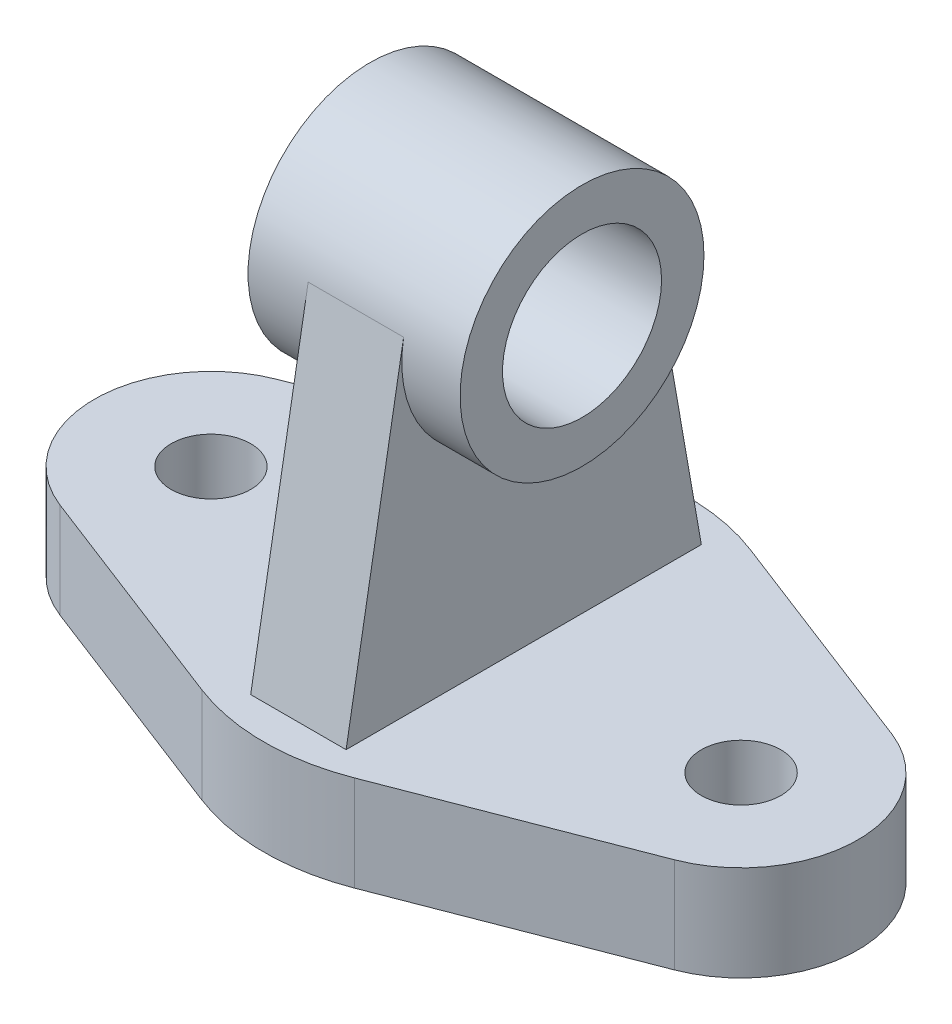
ISO-10303-21;
HEADER;
FILE_DESCRIPTION(('STEP AP214'),'2;1');
FILE_NAME('part.step','',(''),(''),'','','');
FILE_SCHEMA(('AUTOMOTIVE_DESIGN { 1 0 10303 214 1 1 1 1 }'));
ENDSEC;
DATA;
#1=APPLICATION_CONTEXT('core data for automotive mechanical design processes');
#2=APPLICATION_PROTOCOL_DEFINITION('international standard','automotive_design',2000,#1);
#3=PRODUCT_CONTEXT('',#1,'mechanical');
#4=PRODUCT('Part','Part','',(#3));
#5=PRODUCT_RELATED_PRODUCT_CATEGORY('part','',(#4));
#6=PRODUCT_DEFINITION_FORMATION('','',#4);
#7=PRODUCT_DEFINITION_CONTEXT('part definition',#1,'design');
#8=PRODUCT_DEFINITION('design','',#6,#7);
#9=PRODUCT_DEFINITION_SHAPE('','',#8);
#10=(LENGTH_UNIT() NAMED_UNIT(*) SI_UNIT(.MILLI.,.METRE.));
#11=(NAMED_UNIT(*) PLANE_ANGLE_UNIT() SI_UNIT($,.RADIAN.));
#12=(NAMED_UNIT(*) SI_UNIT($,.STERADIAN.) SOLID_ANGLE_UNIT());
#13=UNCERTAINTY_MEASURE_WITH_UNIT(LENGTH_MEASURE(1.E-05),#10,'distance_accuracy_value','');
#14=(GEOMETRIC_REPRESENTATION_CONTEXT(3) GLOBAL_UNCERTAINTY_ASSIGNED_CONTEXT((#13)) GLOBAL_UNIT_ASSIGNED_CONTEXT((#10,
#11,#12)) REPRESENTATION_CONTEXT('',''));
#15=CARTESIAN_POINT('',(0.,0.,0.));
#16=DIRECTION('',(0.,0.,1.));
#17=DIRECTION('',(1.,0.,0.));
#18=AXIS2_PLACEMENT_3D('',#15,#16,#17);
#19=CARTESIAN_POINT('',(-50.,18.,0.));
#20=DIRECTION('',(0.,-1.,0.));
#21=DIRECTION('',(0.,0.,-1.));
#22=AXIS2_PLACEMENT_3D('',#19,#20,#21);
#23=PLANE('',#22);
#24=DIRECTION('',(-1.,0.,0.));
#25=VECTOR('',#24,1.);
#26=CARTESIAN_POINT('',(9.,18.,-33.5));
#27=LINE('',#26,#25);
#28=CARTESIAN_POINT('',(8.99999999999999,18.,-33.5));
#29=VERTEX_POINT('',#28);
#30=CARTESIAN_POINT('',(-9.,18.,-33.5));
#31=VERTEX_POINT('',#30);
#32=EDGE_CURVE('E55',#29,#31,#27,.T.);
#33=ORIENTED_EDGE('',*,*,#32,.F.);
#34=DIRECTION('',(0.,0.,-1.));
#35=VECTOR('',#34,1.);
#36=CARTESIAN_POINT('',(9.,18.,0.));
#37=LINE('',#36,#35);
#38=CARTESIAN_POINT('',(8.99999999999999,18.,33.5));
#39=VERTEX_POINT('',#38);
#40=EDGE_CURVE('E50',#39,#29,#37,.T.);
#41=ORIENTED_EDGE('',*,*,#40,.F.);
#42=DIRECTION('',(-1.,0.,0.));
#43=VECTOR('',#42,1.);
#44=CARTESIAN_POINT('',(9.,18.,33.5));
#45=LINE('',#44,#43);
#46=CARTESIAN_POINT('',(-9.,18.,33.5));
#47=VERTEX_POINT('',#46);
#48=EDGE_CURVE('E144',#39,#47,#45,.T.);
#49=ORIENTED_EDGE('',*,*,#48,.T.);
#50=DIRECTION('',(0.,0.,-1.));
#51=VECTOR('',#50,1.);
#52=CARTESIAN_POINT('',(-9.,18.,0.));
#53=LINE('',#52,#51);
#54=EDGE_CURVE('E147',#47,#31,#53,.T.);
#55=ORIENTED_EDGE('',*,*,#54,.T.);
#56=EDGE_LOOP('',(#33,#41,#49,#55));
#57=FACE_BOUND('',#56,.T.);
#58=CARTESIAN_POINT('',(-50.,18.,0.));
#59=DIRECTION('',(0.,1.,0.));
#60=DIRECTION('',(0.,0.,-1.));
#61=AXIS2_PLACEMENT_3D('',#58,#59,#60);
#62=CIRCLE('',#61,22.);
#63=CARTESIAN_POINT('',(-57.92,18.,-20.5249506698555));
#64=VERTEX_POINT('',#63);
#65=CARTESIAN_POINT('',(-57.92,18.,20.5249506698554));
#66=VERTEX_POINT('',#65);
#67=EDGE_CURVE('E171',#64,#66,#62,.T.);
#68=ORIENTED_EDGE('',*,*,#67,.T.);
#69=DIRECTION('',(0.932952303175248,0.,0.36));
#70=VECTOR('',#69,1.);
#71=CARTESIAN_POINT('',(-57.92,18.,20.5249506698554));
#72=LINE('',#71,#70);
#73=CARTESIAN_POINT('',(-14.4,18.,37.3180921270099));
#74=VERTEX_POINT('',#73);
#75=EDGE_CURVE('E174',#66,#74,#72,.T.);
#76=ORIENTED_EDGE('',*,*,#75,.T.);
#77=CARTESIAN_POINT('',(0.,18.,0.));
#78=DIRECTION('',(0.,1.,0.));
#79=DIRECTION('',(0.,0.,-1.));
#80=AXIS2_PLACEMENT_3D('',#77,#78,#79);
#81=CIRCLE('',#80,40.);
#82=CARTESIAN_POINT('',(14.4,18.,37.3180921270099));
#83=VERTEX_POINT('',#82);
#84=EDGE_CURVE('E177',#74,#83,#81,.T.);
#85=ORIENTED_EDGE('',*,*,#84,.T.);
#86=DIRECTION('',(0.932952303175248,0.,-0.36));
#87=VECTOR('',#86,1.);
#88=CARTESIAN_POINT('',(14.4,18.,37.3180921270099));
#89=LINE('',#88,#87);
#90=CARTESIAN_POINT('',(57.92,18.,20.5249506698554));
#91=VERTEX_POINT('',#90);
#92=EDGE_CURVE('E179',#83,#91,#89,.T.);
#93=ORIENTED_EDGE('',*,*,#92,.T.);
#94=CARTESIAN_POINT('',(50.,18.,0.));
#95=DIRECTION('',(0.,1.,0.));
#96=DIRECTION('',(0.,0.,1.));
#97=AXIS2_PLACEMENT_3D('',#94,#95,#96);
#98=CIRCLE('',#97,22.);
#99=CARTESIAN_POINT('',(57.92,18.,-20.5249506698554));
#100=VERTEX_POINT('',#99);
#101=EDGE_CURVE('E181',#91,#100,#98,.T.);
#102=ORIENTED_EDGE('',*,*,#101,.T.);
#103=DIRECTION('',(-0.932952303175248,0.,-0.36));
#104=VECTOR('',#103,1.);
#105=CARTESIAN_POINT('',(57.92,18.,-20.5249506698555));
#106=LINE('',#105,#104);
#107=CARTESIAN_POINT('',(14.4,18.,-37.3180921270099));
#108=VERTEX_POINT('',#107);
#109=EDGE_CURVE('E183',#100,#108,#106,.T.);
#110=ORIENTED_EDGE('',*,*,#109,.T.);
#111=CARTESIAN_POINT('',(0.,18.,0.));
#112=DIRECTION('',(0.,1.,0.));
#113=DIRECTION('',(0.,0.,1.));
#114=AXIS2_PLACEMENT_3D('',#111,#112,#113);
#115=CIRCLE('',#114,40.);
#116=CARTESIAN_POINT('',(-14.4,18.,-37.3180921270099));
#117=VERTEX_POINT('',#116);
#118=EDGE_CURVE('E185',#108,#117,#115,.T.);
#119=ORIENTED_EDGE('',*,*,#118,.T.);
#120=DIRECTION('',(-0.932952303175248,0.,0.36));
#121=VECTOR('',#120,1.);
#122=CARTESIAN_POINT('',(-14.4,18.,-37.3180921270099));
#123=LINE('',#122,#121);
#124=EDGE_CURVE('E187',#117,#64,#123,.T.);
#125=ORIENTED_EDGE('',*,*,#124,.T.);
#126=EDGE_LOOP('',(#68,#76,#85,#93,#102,#110,#119,#125));
#127=FACE_BOUND('',#126,.T.);
#128=CARTESIAN_POINT('',(50.,18.,0.));
#129=DIRECTION('',(0.,1.,0.));
#130=DIRECTION('',(0.,0.,1.));
#131=AXIS2_PLACEMENT_3D('',#128,#129,#130);
#132=CIRCLE('',#131,7.50000000000001);
#133=CARTESIAN_POINT('',(50.,18.,7.50000000000001));
#134=VERTEX_POINT('',#133);
#135=EDGE_CURVE('E165',#134,#134,#132,.T.);
#136=ORIENTED_EDGE('',*,*,#135,.F.);
#137=EDGE_LOOP('',(#136));
#138=FACE_BOUND('',#137,.T.);
#139=CARTESIAN_POINT('',(-50.,18.,0.));
#140=DIRECTION('',(0.,1.,0.));
#141=DIRECTION('',(0.,0.,1.));
#142=AXIS2_PLACEMENT_3D('',#139,#140,#141);
#143=CIRCLE('',#142,7.5);
#144=CARTESIAN_POINT('',(-50.,18.,7.5));
#145=VERTEX_POINT('',#144);
#146=EDGE_CURVE('E159',#145,#145,#143,.T.);
#147=ORIENTED_EDGE('',*,*,#146,.F.);
#148=EDGE_LOOP('',(#147));
#149=FACE_BOUND('',#148,.T.);
#150=ADVANCED_FACE('F35',(#57,#127,#138,#149),#23,.F.);
#151=CARTESIAN_POINT('',(-50.,0.,0.));
#152=DIRECTION('',(0.,-1.,0.));
#153=DIRECTION('',(0.,0.,-1.));
#154=AXIS2_PLACEMENT_3D('',#151,#152,#153);
#155=PLANE('',#154);
#156=CARTESIAN_POINT('',(50.,0.,0.));
#157=DIRECTION('',(0.,1.,0.));
#158=DIRECTION('',(0.,0.,1.));
#159=AXIS2_PLACEMENT_3D('',#156,#157,#158);
#160=CIRCLE('',#159,7.50000000000001);
#161=CARTESIAN_POINT('',(50.,0.,7.50000000000001));
#162=VERTEX_POINT('',#161);
#163=EDGE_CURVE('E162',#162,#162,#160,.T.);
#164=ORIENTED_EDGE('',*,*,#163,.T.);
#165=EDGE_LOOP('',(#164));
#166=FACE_BOUND('',#165,.T.);
#167=CARTESIAN_POINT('',(-50.,0.,0.));
#168=DIRECTION('',(0.,1.,0.));
#169=DIRECTION('',(0.,0.,-1.));
#170=AXIS2_PLACEMENT_3D('',#167,#168,#169);
#171=CIRCLE('',#170,22.);
#172=CARTESIAN_POINT('',(-57.92,0.,-20.5249506698555));
#173=VERTEX_POINT('',#172);
#174=CARTESIAN_POINT('',(-57.92,0.,20.5249506698554));
#175=VERTEX_POINT('',#174);
#176=EDGE_CURVE('E168',#173,#175,#171,.T.);
#177=ORIENTED_EDGE('',*,*,#176,.F.);
#178=DIRECTION('',(-0.932952303175248,0.,0.36));
#179=VECTOR('',#178,1.);
#180=CARTESIAN_POINT('',(-14.4,0.,-37.3180921270099));
#181=LINE('',#180,#179);
#182=CARTESIAN_POINT('',(-14.4,0.,-37.3180921270099));
#183=VERTEX_POINT('',#182);
#184=EDGE_CURVE('E175',#183,#173,#181,.T.);
#185=ORIENTED_EDGE('',*,*,#184,.F.);
#186=CARTESIAN_POINT('',(0.,0.,0.));
#187=DIRECTION('',(0.,1.,0.));
#188=DIRECTION('',(0.,0.,1.));
#189=AXIS2_PLACEMENT_3D('',#186,#187,#188);
#190=CIRCLE('',#189,40.);
#191=CARTESIAN_POINT('',(14.4,0.,-37.3180921270099));
#192=VERTEX_POINT('',#191);
#193=EDGE_CURVE('E202',#192,#183,#190,.T.);
#194=ORIENTED_EDGE('',*,*,#193,.F.);
#195=DIRECTION('',(-0.932952303175248,0.,-0.36));
#196=VECTOR('',#195,1.);
#197=CARTESIAN_POINT('',(57.92,0.,-20.5249506698555));
#198=LINE('',#197,#196);
#199=CARTESIAN_POINT('',(57.92,0.,-20.5249506698554));
#200=VERTEX_POINT('',#199);
#201=EDGE_CURVE('E200',#200,#192,#198,.T.);
#202=ORIENTED_EDGE('',*,*,#201,.F.);
#203=CARTESIAN_POINT('',(50.,0.,0.));
#204=DIRECTION('',(0.,1.,0.));
#205=DIRECTION('',(0.,0.,1.));
#206=AXIS2_PLACEMENT_3D('',#203,#204,#205);
#207=CIRCLE('',#206,22.);
#208=CARTESIAN_POINT('',(57.92,0.,20.5249506698554));
#209=VERTEX_POINT('',#208);
#210=EDGE_CURVE('E198',#209,#200,#207,.T.);
#211=ORIENTED_EDGE('',*,*,#210,.F.);
#212=DIRECTION('',(0.932952303175248,0.,-0.36));
#213=VECTOR('',#212,1.);
#214=CARTESIAN_POINT('',(14.4,0.,37.3180921270099));
#215=LINE('',#214,#213);
#216=CARTESIAN_POINT('',(14.4,0.,37.3180921270099));
#217=VERTEX_POINT('',#216);
#218=EDGE_CURVE('E196',#217,#209,#215,.T.);
#219=ORIENTED_EDGE('',*,*,#218,.F.);
#220=CARTESIAN_POINT('',(0.,0.,0.));
#221=DIRECTION('',(0.,1.,0.));
#222=DIRECTION('',(0.,0.,-1.));
#223=AXIS2_PLACEMENT_3D('',#220,#221,#222);
#224=CIRCLE('',#223,40.);
#225=CARTESIAN_POINT('',(-14.4,0.,37.3180921270099));
#226=VERTEX_POINT('',#225);
#227=EDGE_CURVE('E194',#226,#217,#224,.T.);
#228=ORIENTED_EDGE('',*,*,#227,.F.);
#229=DIRECTION('',(0.932952303175248,0.,0.36));
#230=VECTOR('',#229,1.);
#231=CARTESIAN_POINT('',(-57.92,0.,20.5249506698554));
#232=LINE('',#231,#230);
#233=EDGE_CURVE('E192',#175,#226,#232,.T.);
#234=ORIENTED_EDGE('',*,*,#233,.F.);
#235=EDGE_LOOP('',(#177,#185,#194,#202,#211,#219,#228,#234));
#236=FACE_BOUND('',#235,.T.);
#237=CARTESIAN_POINT('',(-50.,0.,0.));
#238=DIRECTION('',(0.,1.,0.));
#239=DIRECTION('',(0.,0.,1.));
#240=AXIS2_PLACEMENT_3D('',#237,#238,#239);
#241=CIRCLE('',#240,7.5);
#242=CARTESIAN_POINT('',(-50.,0.,7.5));
#243=VERTEX_POINT('',#242);
#244=EDGE_CURVE('E143',#243,#243,#241,.T.);
#245=ORIENTED_EDGE('',*,*,#244,.T.);
#246=EDGE_LOOP('',(#245));
#247=FACE_BOUND('',#246,.T.);
#248=ADVANCED_FACE('F232',(#166,#236,#247),#155,.T.);
#249=CARTESIAN_POINT('',(-50.,18.,0.));
#250=DIRECTION('',(0.,-1.,0.));
#251=DIRECTION('',(0.,0.,-1.));
#252=AXIS2_PLACEMENT_3D('',#249,#250,#251);
#253=CYLINDRICAL_SURFACE('',#252,22.);
#254=ORIENTED_EDGE('',*,*,#176,.T.);
#255=DIRECTION('',(0.,-1.,0.));
#256=VECTOR('',#255,1.);
#257=CARTESIAN_POINT('',(-57.92,18.,20.5249506698554));
#258=LINE('',#257,#256);
#259=EDGE_CURVE('E11',#66,#175,#258,.T.);
#260=ORIENTED_EDGE('',*,*,#259,.F.);
#261=ORIENTED_EDGE('',*,*,#67,.F.);
#262=DIRECTION('',(0.,-1.,0.));
#263=VECTOR('',#262,1.);
#264=CARTESIAN_POINT('',(-57.92,18.,-20.5249506698555));
#265=LINE('',#264,#263);
#266=EDGE_CURVE('E189',#64,#173,#265,.T.);
#267=ORIENTED_EDGE('',*,*,#266,.T.);
#268=EDGE_LOOP('',(#254,#260,#261,#267));
#269=FACE_BOUND('',#268,.T.);
#270=ADVANCED_FACE('F37',(#269),#253,.T.);
#271=CARTESIAN_POINT('',(-57.92,18.,20.5249506698554));
#272=DIRECTION('',(0.36,0.,-0.932952303175248));
#273=DIRECTION('',(-0.932952303175248,0.,-0.36));
#274=AXIS2_PLACEMENT_3D('',#271,#272,#273);
#275=PLANE('',#274);
#276=ORIENTED_EDGE('',*,*,#233,.T.);
#277=DIRECTION('',(0.,-1.,0.));
#278=VECTOR('',#277,1.);
#279=CARTESIAN_POINT('',(-14.4,18.,37.3180921270099));
#280=LINE('',#279,#278);
#281=EDGE_CURVE('E43',#74,#226,#280,.T.);
#282=ORIENTED_EDGE('',*,*,#281,.F.);
#283=ORIENTED_EDGE('',*,*,#75,.F.);
#284=ORIENTED_EDGE('',*,*,#259,.T.);
#285=EDGE_LOOP('',(#276,#282,#283,#284));
#286=FACE_BOUND('',#285,.T.);
#287=ADVANCED_FACE('F250',(#286),#275,.F.);
#288=CARTESIAN_POINT('',(0.,18.,0.));
#289=DIRECTION('',(0.,-1.,0.));
#290=DIRECTION('',(0.,0.,-1.));
#291=AXIS2_PLACEMENT_3D('',#288,#289,#290);
#292=CYLINDRICAL_SURFACE('',#291,40.);
#293=ORIENTED_EDGE('',*,*,#227,.T.);
#294=DIRECTION('',(0.,-1.,0.));
#295=VECTOR('',#294,1.);
#296=CARTESIAN_POINT('',(14.4,18.,37.3180921270099));
#297=LINE('',#296,#295);
#298=EDGE_CURVE('E219',#83,#217,#297,.T.);
#299=ORIENTED_EDGE('',*,*,#298,.F.);
#300=ORIENTED_EDGE('',*,*,#84,.F.);
#301=ORIENTED_EDGE('',*,*,#281,.T.);
#302=EDGE_LOOP('',(#293,#299,#300,#301));
#303=FACE_BOUND('',#302,.T.);
#304=ADVANCED_FACE('F226',(#303),#292,.T.);
#305=CARTESIAN_POINT('',(14.4,18.,37.3180921270099));
#306=DIRECTION('',(-0.36,0.,-0.932952303175248));
#307=DIRECTION('',(-0.932952303175248,0.,0.36));
#308=AXIS2_PLACEMENT_3D('',#305,#306,#307);
#309=PLANE('',#308);
#310=ORIENTED_EDGE('',*,*,#218,.T.);
#311=DIRECTION('',(0.,-1.,0.));
#312=VECTOR('',#311,1.);
#313=CARTESIAN_POINT('',(57.92,18.,20.5249506698554));
#314=LINE('',#313,#312);
#315=EDGE_CURVE('E216',#91,#209,#314,.T.);
#316=ORIENTED_EDGE('',*,*,#315,.F.);
#317=ORIENTED_EDGE('',*,*,#92,.F.);
#318=ORIENTED_EDGE('',*,*,#298,.T.);
#319=EDGE_LOOP('',(#310,#316,#317,#318));
#320=FACE_BOUND('',#319,.T.);
#321=ADVANCED_FACE('F238',(#320),#309,.F.);
#322=CARTESIAN_POINT('',(50.,18.,0.));
#323=DIRECTION('',(0.,-1.,0.));
#324=DIRECTION('',(0.,0.,-1.));
#325=AXIS2_PLACEMENT_3D('',#322,#323,#324);
#326=CYLINDRICAL_SURFACE('',#325,22.);
#327=ORIENTED_EDGE('',*,*,#210,.T.);
#328=DIRECTION('',(0.,-1.,0.));
#329=VECTOR('',#328,1.);
#330=CARTESIAN_POINT('',(57.92,18.,-20.5249506698554));
#331=LINE('',#330,#329);
#332=EDGE_CURVE('E213',#100,#200,#331,.T.);
#333=ORIENTED_EDGE('',*,*,#332,.F.);
#334=ORIENTED_EDGE('',*,*,#101,.F.);
#335=ORIENTED_EDGE('',*,*,#315,.T.);
#336=EDGE_LOOP('',(#327,#333,#334,#335));
#337=FACE_BOUND('',#336,.T.);
#338=ADVANCED_FACE('F242',(#337),#326,.T.);
#339=CARTESIAN_POINT('',(57.92,18.,-20.5249506698555));
#340=DIRECTION('',(-0.36,0.,0.932952303175248));
#341=DIRECTION('',(0.932952303175248,0.,0.36));
#342=AXIS2_PLACEMENT_3D('',#339,#340,#341);
#343=PLANE('',#342);
#344=ORIENTED_EDGE('',*,*,#201,.T.);
#345=DIRECTION('',(0.,-1.,0.));
#346=VECTOR('',#345,1.);
#347=CARTESIAN_POINT('',(14.4,18.,-37.3180921270099));
#348=LINE('',#347,#346);
#349=EDGE_CURVE('E210',#108,#192,#348,.T.);
#350=ORIENTED_EDGE('',*,*,#349,.F.);
#351=ORIENTED_EDGE('',*,*,#109,.F.);
#352=ORIENTED_EDGE('',*,*,#332,.T.);
#353=EDGE_LOOP('',(#344,#350,#351,#352));
#354=FACE_BOUND('',#353,.T.);
#355=ADVANCED_FACE('F263',(#354),#343,.F.);
#356=CARTESIAN_POINT('',(0.,18.,0.));
#357=DIRECTION('',(0.,-1.,0.));
#358=DIRECTION('',(0.,0.,-1.));
#359=AXIS2_PLACEMENT_3D('',#356,#357,#358);
#360=CYLINDRICAL_SURFACE('',#359,40.);
#361=ORIENTED_EDGE('',*,*,#193,.T.);
#362=DIRECTION('',(0.,-1.,0.));
#363=VECTOR('',#362,1.);
#364=CARTESIAN_POINT('',(-14.4,18.,-37.3180921270099));
#365=LINE('',#364,#363);
#366=EDGE_CURVE('E207',#117,#183,#365,.T.);
#367=ORIENTED_EDGE('',*,*,#366,.F.);
#368=ORIENTED_EDGE('',*,*,#118,.F.);
#369=ORIENTED_EDGE('',*,*,#349,.T.);
#370=EDGE_LOOP('',(#361,#367,#368,#369));
#371=FACE_BOUND('',#370,.T.);
#372=ADVANCED_FACE('F261',(#371),#360,.T.);
#373=CARTESIAN_POINT('',(-14.4,18.,-37.3180921270099));
#374=DIRECTION('',(0.36,0.,0.932952303175248));
#375=DIRECTION('',(0.932952303175248,0.,-0.36));
#376=AXIS2_PLACEMENT_3D('',#373,#374,#375);
#377=PLANE('',#376);
#378=ORIENTED_EDGE('',*,*,#184,.T.);
#379=ORIENTED_EDGE('',*,*,#266,.F.);
#380=ORIENTED_EDGE('',*,*,#124,.F.);
#381=ORIENTED_EDGE('',*,*,#366,.T.);
#382=EDGE_LOOP('',(#378,#379,#380,#381));
#383=FACE_BOUND('',#382,.T.);
#384=ADVANCED_FACE('F256',(#383),#377,.F.);
#385=CARTESIAN_POINT('',(50.,18.,0.));
#386=DIRECTION('',(0.,-1.,0.));
#387=DIRECTION('',(0.,0.,-1.));
#388=AXIS2_PLACEMENT_3D('',#385,#386,#387);
#389=CYLINDRICAL_SURFACE('',#388,7.50000000000001);
#390=ORIENTED_EDGE('',*,*,#135,.T.);
#391=EDGE_LOOP('',(#390));
#392=FACE_BOUND('',#391,.T.);
#393=ORIENTED_EDGE('',*,*,#163,.F.);
#394=EDGE_LOOP('',(#393));
#395=FACE_BOUND('',#394,.T.);
#396=ADVANCED_FACE('F280',(#392,#395),#389,.F.);
#397=CARTESIAN_POINT('',(-50.,18.,0.));
#398=DIRECTION('',(0.,-1.,0.));
#399=DIRECTION('',(0.,0.,-1.));
#400=AXIS2_PLACEMENT_3D('',#397,#398,#399);
#401=CYLINDRICAL_SURFACE('',#400,7.5);
#402=ORIENTED_EDGE('',*,*,#146,.T.);
#403=EDGE_LOOP('',(#402));
#404=FACE_BOUND('',#403,.T.);
#405=ORIENTED_EDGE('',*,*,#244,.F.);
#406=EDGE_LOOP('',(#405));
#407=FACE_BOUND('',#406,.T.);
#408=ADVANCED_FACE('F287',(#404,#407),#401,.F.);
#409=CARTESIAN_POINT('',(9.,6.22344150471915,35.5609867609938));
#410=DIRECTION('',(0.,-0.172387556761774,-0.985029202751729));
#411=DIRECTION('',(0.,0.985029202751729,-0.172387556761774));
#412=AXIS2_PLACEMENT_3D('',#409,#410,#411);
#413=PLANE('',#412);
#414=DIRECTION('',(0.,-0.985029202751729,0.172387556761774));
#415=VECTOR('',#414,1.);
#416=CARTESIAN_POINT('',(-9.,6.22344150471915,35.5609867609938));
#417=LINE('',#416,#415);
#418=CARTESIAN_POINT('',(-9.,79.9649138055208,22.6556716632898));
#419=VERTEX_POINT('',#418);
#420=EDGE_CURVE('E133',#419,#47,#417,.T.);
#421=ORIENTED_EDGE('',*,*,#420,.T.);
#422=ORIENTED_EDGE('',*,*,#48,.F.);
#423=DIRECTION('',(0.,-0.985029202751729,0.172387556761774));
#424=VECTOR('',#423,1.);
#425=CARTESIAN_POINT('',(9.,6.22344150471915,35.5609867609938));
#426=LINE('',#425,#424);
#427=CARTESIAN_POINT('',(9.,79.9649138055208,22.6556716632898));
#428=VERTEX_POINT('',#427);
#429=EDGE_CURVE('E141',#428,#39,#426,.T.);
#430=ORIENTED_EDGE('',*,*,#429,.F.);
#431=DIRECTION('',(-1.,0.,0.));
#432=VECTOR('',#431,1.);
#433=CARTESIAN_POINT('',(9.,79.9649138055208,22.6556716632898));
#434=LINE('',#433,#432);
#435=EDGE_CURVE('E125',#428,#419,#434,.T.);
#436=ORIENTED_EDGE('',*,*,#435,.T.);
#437=EDGE_LOOP('',(#421,#422,#430,#436));
#438=FACE_BOUND('',#437,.T.);
#439=ADVANCED_FACE('F138',(#438),#413,.F.);
#440=CARTESIAN_POINT('',(9.,6.22344150471915,-35.5609867609938));
#441=DIRECTION('',(0.,0.172387556761774,-0.985029202751729));
#442=DIRECTION('',(0.,0.985029202751729,0.172387556761774));
#443=AXIS2_PLACEMENT_3D('',#440,#441,#442);
#444=PLANE('',#443);
#445=DIRECTION('',(0.,-0.985029202751729,-0.172387556761774));
#446=VECTOR('',#445,1.);
#447=CARTESIAN_POINT('',(-9.,6.22344150471915,-35.5609867609938));
#448=LINE('',#447,#446);
#449=CARTESIAN_POINT('',(-9.,79.9649138055208,-22.6556716632898));
#450=VERTEX_POINT('',#449);
#451=EDGE_CURVE('E149',#450,#31,#448,.T.);
#452=ORIENTED_EDGE('',*,*,#451,.F.);
#453=DIRECTION('',(-1.,0.,0.));
#454=VECTOR('',#453,1.);
#455=CARTESIAN_POINT('',(9.,79.9649138055208,-22.6556716632898));
#456=LINE('',#455,#454);
#457=CARTESIAN_POINT('',(9.,79.9649138055208,-22.6556716632898));
#458=VERTEX_POINT('',#457);
#459=EDGE_CURVE('E128',#458,#450,#456,.T.);
#460=ORIENTED_EDGE('',*,*,#459,.F.);
#461=DIRECTION('',(0.,-0.985029202751729,-0.172387556761774));
#462=VECTOR('',#461,1.);
#463=CARTESIAN_POINT('',(9.,6.22344150471915,-35.5609867609938));
#464=LINE('',#463,#462);
#465=EDGE_CURVE('E156',#458,#29,#464,.T.);
#466=ORIENTED_EDGE('',*,*,#465,.T.);
#467=ORIENTED_EDGE('',*,*,#32,.T.);
#468=EDGE_LOOP('',(#452,#460,#466,#467));
#469=FACE_BOUND('',#468,.T.);
#470=ADVANCED_FACE('F303',(#469),#444,.T.);
#471=CARTESIAN_POINT('',(9.,0.,0.));
#472=DIRECTION('',(1.,0.,0.));
#473=DIRECTION('',(0.,0.,-1.));
#474=AXIS2_PLACEMENT_3D('',#471,#472,#473);
#475=PLANE('',#474);
#476=CARTESIAN_POINT('',(9.,76.,0.));
#477=DIRECTION('',(1.,0.,0.));
#478=DIRECTION('',(0.,0.,-1.));
#479=AXIS2_PLACEMENT_3D('',#476,#477,#478);
#480=CIRCLE('',#479,23.);
#481=EDGE_CURVE('E154',#428,#458,#480,.T.);
#482=ORIENTED_EDGE('',*,*,#481,.F.);
#483=ORIENTED_EDGE('',*,*,#429,.T.);
#484=ORIENTED_EDGE('',*,*,#40,.T.);
#485=ORIENTED_EDGE('',*,*,#465,.F.);
#486=EDGE_LOOP('',(#482,#483,#484,#485));
#487=FACE_BOUND('',#486,.T.);
#488=ADVANCED_FACE('F308',(#487),#475,.T.);
#489=CARTESIAN_POINT('',(-9.,0.,0.));
#490=DIRECTION('',(1.,0.,0.));
#491=DIRECTION('',(0.,0.,-1.));
#492=AXIS2_PLACEMENT_3D('',#489,#490,#491);
#493=PLANE('',#492);
#494=CARTESIAN_POINT('',(-9.,76.,0.));
#495=DIRECTION('',(1.,0.,0.));
#496=DIRECTION('',(0.,0.,-1.));
#497=AXIS2_PLACEMENT_3D('',#494,#495,#496);
#498=CIRCLE('',#497,23.);
#499=EDGE_CURVE('E121',#419,#450,#498,.T.);
#500=ORIENTED_EDGE('',*,*,#499,.T.);
#501=ORIENTED_EDGE('',*,*,#451,.T.);
#502=ORIENTED_EDGE('',*,*,#54,.F.);
#503=ORIENTED_EDGE('',*,*,#420,.F.);
#504=EDGE_LOOP('',(#500,#501,#502,#503));
#505=FACE_BOUND('',#504,.T.);
#506=ADVANCED_FACE('F146',(#505),#493,.F.);
#507=CARTESIAN_POINT('',(20.,76.,0.));
#508=DIRECTION('',(-1.,0.,0.));
#509=DIRECTION('',(0.,0.,1.));
#510=AXIS2_PLACEMENT_3D('',#507,#508,#509);
#511=CYLINDRICAL_SURFACE('',#510,15.);
#512=CARTESIAN_POINT('',(20.,76.,0.));
#513=DIRECTION('',(1.,0.,0.));
#514=DIRECTION('',(0.,0.,-1.));
#515=AXIS2_PLACEMENT_3D('',#512,#513,#514);
#516=CIRCLE('',#515,15.);
#517=CARTESIAN_POINT('',(20.,76.,-15.));
#518=VERTEX_POINT('',#517);
#519=EDGE_CURVE('E333',#518,#518,#516,.T.);
#520=ORIENTED_EDGE('',*,*,#519,.T.);
#521=EDGE_LOOP('',(#520));
#522=FACE_BOUND('',#521,.T.);
#523=CARTESIAN_POINT('',(-20.,76.,0.));
#524=DIRECTION('',(1.,0.,0.));
#525=DIRECTION('',(0.,0.,-1.));
#526=AXIS2_PLACEMENT_3D('',#523,#524,#525);
#527=CIRCLE('',#526,15.);
#528=CARTESIAN_POINT('',(-20.,76.,-15.));
#529=VERTEX_POINT('',#528);
#530=EDGE_CURVE('E340',#529,#529,#527,.T.);
#531=ORIENTED_EDGE('',*,*,#530,.F.);
#532=EDGE_LOOP('',(#531));
#533=FACE_BOUND('',#532,.T.);
#534=ADVANCED_FACE('F312',(#522,#533),#511,.F.);
#535=CARTESIAN_POINT('',(20.,76.,0.));
#536=DIRECTION('',(-1.,0.,0.));
#537=DIRECTION('',(0.,0.,1.));
#538=AXIS2_PLACEMENT_3D('',#535,#536,#537);
#539=CYLINDRICAL_SURFACE('',#538,23.);
#540=ORIENTED_EDGE('',*,*,#481,.T.);
#541=ORIENTED_EDGE('',*,*,#459,.T.);
#542=ORIENTED_EDGE('',*,*,#499,.F.);
#543=ORIENTED_EDGE('',*,*,#435,.F.);
#544=EDGE_LOOP('',(#540,#541,#542,#543));
#545=FACE_BOUND('',#544,.T.);
#546=CARTESIAN_POINT('',(20.,76.,0.));
#547=DIRECTION('',(1.,0.,0.));
#548=DIRECTION('',(0.,0.,-1.));
#549=AXIS2_PLACEMENT_3D('',#546,#547,#548);
#550=CIRCLE('',#549,23.);
#551=CARTESIAN_POINT('',(20.,76.,-23.));
#552=VERTEX_POINT('',#551);
#553=EDGE_CURVE('E134',#552,#552,#550,.T.);
#554=ORIENTED_EDGE('',*,*,#553,.F.);
#555=EDGE_LOOP('',(#554));
#556=FACE_BOUND('',#555,.T.);
#557=CARTESIAN_POINT('',(-20.,76.,0.));
#558=DIRECTION('',(1.,0.,0.));
#559=DIRECTION('',(0.,0.,-1.));
#560=AXIS2_PLACEMENT_3D('',#557,#558,#559);
#561=CIRCLE('',#560,23.);
#562=CARTESIAN_POINT('',(-20.,76.,-23.));
#563=VERTEX_POINT('',#562);
#564=EDGE_CURVE('E337',#563,#563,#561,.T.);
#565=ORIENTED_EDGE('',*,*,#564,.T.);
#566=EDGE_LOOP('',(#565));
#567=FACE_BOUND('',#566,.T.);
#568=ADVANCED_FACE('F123',(#545,#556,#567),#539,.T.);
#569=CARTESIAN_POINT('',(20.,0.,0.));
#570=DIRECTION('',(1.,0.,0.));
#571=DIRECTION('',(0.,0.,-1.));
#572=AXIS2_PLACEMENT_3D('',#569,#570,#571);
#573=PLANE('',#572);
#574=ORIENTED_EDGE('',*,*,#519,.F.);
#575=EDGE_LOOP('',(#574));
#576=FACE_BOUND('',#575,.T.);
#577=ORIENTED_EDGE('',*,*,#553,.T.);
#578=EDGE_LOOP('',(#577));
#579=FACE_BOUND('',#578,.T.);
#580=ADVANCED_FACE('F321',(#576,#579),#573,.T.);
#581=CARTESIAN_POINT('',(-20.,0.,0.));
#582=DIRECTION('',(1.,0.,0.));
#583=DIRECTION('',(0.,0.,-1.));
#584=AXIS2_PLACEMENT_3D('',#581,#582,#583);
#585=PLANE('',#584);
#586=ORIENTED_EDGE('',*,*,#530,.T.);
#587=EDGE_LOOP('',(#586));
#588=FACE_BOUND('',#587,.T.);
#589=ORIENTED_EDGE('',*,*,#564,.F.);
#590=EDGE_LOOP('',(#589));
#591=FACE_BOUND('',#590,.T.);
#592=ADVANCED_FACE('F322',(#588,#591),#585,.F.);
#593=CLOSED_SHELL('',(#150,#248,#270,#287,#304,#321,#338,#355,#372,#384,#396,#408,#439,#470,
#488,#506,#534,#568,#580,#592));
#594=MANIFOLD_SOLID_BREP('B2',#593);
#595=ADVANCED_BREP_SHAPE_REPRESENTATION('',(#18,#594),#14);
#596=SHAPE_DEFINITION_REPRESENTATION(#9,#595);
ENDSEC;
END-ISO-10303-21;
